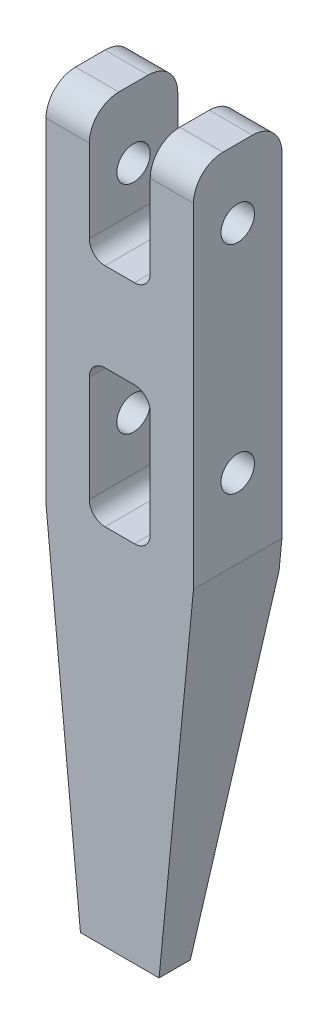
ISO-10303-21;
HEADER;
FILE_DESCRIPTION(('STEP AP214'),'2;1');
FILE_NAME('part.step','',(''),(''),'','','');
FILE_SCHEMA(('AUTOMOTIVE_DESIGN { 1 0 10303 214 1 1 1 1 }'));
ENDSEC;
DATA;
#1=APPLICATION_CONTEXT('core data for automotive mechanical design processes');
#2=APPLICATION_PROTOCOL_DEFINITION('international standard','automotive_design',2000,#1);
#3=PRODUCT_CONTEXT('',#1,'mechanical');
#4=PRODUCT('Part','Part','',(#3));
#5=PRODUCT_RELATED_PRODUCT_CATEGORY('part','',(#4));
#6=PRODUCT_DEFINITION_FORMATION('','',#4);
#7=PRODUCT_DEFINITION_CONTEXT('part definition',#1,'design');
#8=PRODUCT_DEFINITION('design','',#6,#7);
#9=PRODUCT_DEFINITION_SHAPE('','',#8);
#10=(LENGTH_UNIT() NAMED_UNIT(*) SI_UNIT(.MILLI.,.METRE.));
#11=(NAMED_UNIT(*) PLANE_ANGLE_UNIT() SI_UNIT($,.RADIAN.));
#12=(NAMED_UNIT(*) SI_UNIT($,.STERADIAN.) SOLID_ANGLE_UNIT());
#13=UNCERTAINTY_MEASURE_WITH_UNIT(LENGTH_MEASURE(1.E-05),#10,'distance_accuracy_value','');
#14=(GEOMETRIC_REPRESENTATION_CONTEXT(3) GLOBAL_UNCERTAINTY_ASSIGNED_CONTEXT((#13)) GLOBAL_UNIT_ASSIGNED_CONTEXT((#10,
#11,#12)) REPRESENTATION_CONTEXT('',''));
#15=CARTESIAN_POINT('',(0.,0.,0.));
#16=DIRECTION('',(0.,0.,1.));
#17=DIRECTION('',(1.,0.,0.));
#18=AXIS2_PLACEMENT_3D('',#15,#16,#17);
#19=CARTESIAN_POINT('',(3.75,-33.,2.25));
#20=DIRECTION('',(0.,0.,-1.));
#21=DIRECTION('',(0.,1.,0.));
#22=AXIS2_PLACEMENT_3D('',#19,#20,#21);
#23=PLANE('',#22);
#24=DIRECTION('',(-1.,0.,0.));
#25=VECTOR('',#24,1.);
#26=CARTESIAN_POINT('',(3.75,-33.,2.25));
#27=LINE('',#26,#25);
#28=CARTESIAN_POINT('',(2.,-33.,2.25));
#29=VERTEX_POINT('',#28);
#30=CARTESIAN_POINT('',(-2.,-33.,2.25));
#31=VERTEX_POINT('',#30);
#32=EDGE_CURVE('E242',#29,#31,#27,.T.);
#33=ORIENTED_EDGE('',*,*,#32,.F.);
#34=DIRECTION('',(-0.0967659740606516,-0.995307161766705,0.));
#35=VECTOR('',#34,1.);
#36=CARTESIAN_POINT('',(3.75,-15.,2.25));
#37=LINE('',#36,#35);
#38=CARTESIAN_POINT('',(3.75,-15.,2.25));
#39=VERTEX_POINT('',#38);
#40=EDGE_CURVE('E206',#39,#29,#37,.T.);
#41=ORIENTED_EDGE('',*,*,#40,.F.);
#42=DIRECTION('',(0.,-1.,0.));
#43=VECTOR('',#42,1.);
#44=CARTESIAN_POINT('',(3.75,-33.,2.25));
#45=LINE('',#44,#43);
#46=CARTESIAN_POINT('',(3.75,2.,2.25));
#47=VERTEX_POINT('',#46);
#48=EDGE_CURVE('E215',#47,#39,#45,.T.);
#49=ORIENTED_EDGE('',*,*,#48,.F.);
#50=DIRECTION('',(-1.,0.,0.));
#51=VECTOR('',#50,1.);
#52=CARTESIAN_POINT('',(3.75,2.,2.25));
#53=LINE('',#52,#51);
#54=CARTESIAN_POINT('',(1.55,2.,2.25));
#55=VERTEX_POINT('',#54);
#56=EDGE_CURVE('E264',#47,#55,#53,.T.);
#57=ORIENTED_EDGE('',*,*,#56,.T.);
#58=DIRECTION('',(0.,-1.,0.));
#59=VECTOR('',#58,1.);
#60=CARTESIAN_POINT('',(1.55,0.,2.25));
#61=LINE('',#60,#59);
#62=CARTESIAN_POINT('',(1.55,-2.2,2.25));
#63=VERTEX_POINT('',#62);
#64=EDGE_CURVE('E261',#55,#63,#61,.T.);
#65=ORIENTED_EDGE('',*,*,#64,.T.);
#66=CARTESIAN_POINT('',(0.750000000000001,-2.2,2.25));
#67=DIRECTION('',(0.,0.,-1.));
#68=DIRECTION('',(0.,1.,0.));
#69=AXIS2_PLACEMENT_3D('',#66,#67,#68);
#70=CIRCLE('',#69,0.8);
#71=CARTESIAN_POINT('',(0.750000000000001,-3.,2.25));
#72=VERTEX_POINT('',#71);
#73=EDGE_CURVE('E347',#63,#72,#70,.T.);
#74=ORIENTED_EDGE('',*,*,#73,.T.);
#75=DIRECTION('',(1.,0.,0.));
#76=VECTOR('',#75,1.);
#77=CARTESIAN_POINT('',(0.,-3.,2.25));
#78=LINE('',#77,#76);
#79=CARTESIAN_POINT('',(-0.75,-3.,2.25));
#80=VERTEX_POINT('',#79);
#81=EDGE_CURVE('E401',#80,#72,#78,.T.);
#82=ORIENTED_EDGE('',*,*,#81,.F.);
#83=CARTESIAN_POINT('',(-0.75,-2.2,2.25));
#84=DIRECTION('',(0.,0.,-1.));
#85=DIRECTION('',(0.,1.,0.));
#86=AXIS2_PLACEMENT_3D('',#83,#84,#85);
#87=CIRCLE('',#86,0.8);
#88=CARTESIAN_POINT('',(-1.55,-2.2,2.25));
#89=VERTEX_POINT('',#88);
#90=EDGE_CURVE('E343',#80,#89,#87,.T.);
#91=ORIENTED_EDGE('',*,*,#90,.T.);
#92=DIRECTION('',(0.,-1.,0.));
#93=VECTOR('',#92,1.);
#94=CARTESIAN_POINT('',(-1.55,0.,2.25));
#95=LINE('',#94,#93);
#96=CARTESIAN_POINT('',(-1.55,2.,2.25));
#97=VERTEX_POINT('',#96);
#98=EDGE_CURVE('E398',#97,#89,#95,.T.);
#99=ORIENTED_EDGE('',*,*,#98,.F.);
#100=DIRECTION('',(-1.,0.,0.));
#101=VECTOR('',#100,1.);
#102=CARTESIAN_POINT('',(3.75,2.,2.25));
#103=LINE('',#102,#101);
#104=CARTESIAN_POINT('',(-3.75,2.,2.25));
#105=VERTEX_POINT('',#104);
#106=EDGE_CURVE('E244',#97,#105,#103,.T.);
#107=ORIENTED_EDGE('',*,*,#106,.T.);
#108=DIRECTION('',(0.,-1.,0.));
#109=VECTOR('',#108,1.);
#110=CARTESIAN_POINT('',(-3.75,-33.,2.25));
#111=LINE('',#110,#109);
#112=CARTESIAN_POINT('',(-3.75,-15.,2.25));
#113=VERTEX_POINT('',#112);
#114=EDGE_CURVE('E231',#105,#113,#111,.T.);
#115=ORIENTED_EDGE('',*,*,#114,.T.);
#116=DIRECTION('',(-0.096765974060652,0.995307161766705,0.));
#117=VECTOR('',#116,1.);
#118=CARTESIAN_POINT('',(-3.75,-15.,2.25));
#119=LINE('',#118,#117);
#120=EDGE_CURVE('E370',#31,#113,#119,.T.);
#121=ORIENTED_EDGE('',*,*,#120,.F.);
#122=EDGE_LOOP('',(#33,#41,#49,#57,#65,#74,#82,#91,#99,#107,#115,#121));
#123=FACE_BOUND('',#122,.T.);
#124=DIRECTION('',(0.,-1.,0.));
#125=VECTOR('',#124,1.);
#126=CARTESIAN_POINT('',(-1.55,-7.5,2.25));
#127=LINE('',#126,#125);
#128=CARTESIAN_POINT('',(-1.55,-8.3,2.25));
#129=VERTEX_POINT('',#128);
#130=CARTESIAN_POINT('',(-1.55,-13.7,2.25));
#131=VERTEX_POINT('',#130);
#132=EDGE_CURVE('E385',#129,#131,#127,.T.);
#133=ORIENTED_EDGE('',*,*,#132,.F.);
#134=CARTESIAN_POINT('',(-0.749999999999999,-8.3,2.25));
#135=DIRECTION('',(0.,0.,-1.));
#136=DIRECTION('',(0.,1.,0.));
#137=AXIS2_PLACEMENT_3D('',#134,#135,#136);
#138=CIRCLE('',#137,0.8);
#139=CARTESIAN_POINT('',(-0.749999999999999,-7.5,2.25));
#140=VERTEX_POINT('',#139);
#141=EDGE_CURVE('E331',#129,#140,#138,.T.);
#142=ORIENTED_EDGE('',*,*,#141,.T.);
#143=DIRECTION('',(1.,0.,0.));
#144=VECTOR('',#143,1.);
#145=CARTESIAN_POINT('',(-1.55,-7.5,2.25));
#146=LINE('',#145,#144);
#147=CARTESIAN_POINT('',(0.750000000000001,-7.5,2.25));
#148=VERTEX_POINT('',#147);
#149=EDGE_CURVE('E258',#140,#148,#146,.T.);
#150=ORIENTED_EDGE('',*,*,#149,.T.);
#151=CARTESIAN_POINT('',(0.750000000000001,-8.3,2.25));
#152=DIRECTION('',(0.,0.,-1.));
#153=DIRECTION('',(0.,1.,0.));
#154=AXIS2_PLACEMENT_3D('',#151,#152,#153);
#155=CIRCLE('',#154,0.8);
#156=CARTESIAN_POINT('',(1.55,-8.3,2.25));
#157=VERTEX_POINT('',#156);
#158=EDGE_CURVE('E327',#148,#157,#155,.T.);
#159=ORIENTED_EDGE('',*,*,#158,.T.);
#160=DIRECTION('',(0.,-1.,0.));
#161=VECTOR('',#160,1.);
#162=CARTESIAN_POINT('',(1.55,-7.5,2.25));
#163=LINE('',#162,#161);
#164=CARTESIAN_POINT('',(1.55,-13.7,2.25));
#165=VERTEX_POINT('',#164);
#166=EDGE_CURVE('E391',#157,#165,#163,.T.);
#167=ORIENTED_EDGE('',*,*,#166,.T.);
#168=CARTESIAN_POINT('',(0.750000000000001,-13.7,2.25));
#169=DIRECTION('',(0.,0.,-1.));
#170=DIRECTION('',(0.,1.,0.));
#171=AXIS2_PLACEMENT_3D('',#168,#169,#170);
#172=CIRCLE('',#171,0.8);
#173=CARTESIAN_POINT('',(0.750000000000001,-14.5,2.25));
#174=VERTEX_POINT('',#173);
#175=EDGE_CURVE('E335',#165,#174,#172,.T.);
#176=ORIENTED_EDGE('',*,*,#175,.T.);
#177=DIRECTION('',(1.,0.,0.));
#178=VECTOR('',#177,1.);
#179=CARTESIAN_POINT('',(-1.55,-14.5,2.25));
#180=LINE('',#179,#178);
#181=CARTESIAN_POINT('',(-0.749999999999998,-14.5,2.25));
#182=VERTEX_POINT('',#181);
#183=EDGE_CURVE('E388',#182,#174,#180,.T.);
#184=ORIENTED_EDGE('',*,*,#183,.F.);
#185=CARTESIAN_POINT('',(-0.749999999999998,-13.7,2.25));
#186=DIRECTION('',(0.,0.,-1.));
#187=DIRECTION('',(0.,1.,0.));
#188=AXIS2_PLACEMENT_3D('',#185,#186,#187);
#189=CIRCLE('',#188,0.8);
#190=EDGE_CURVE('E339',#182,#131,#189,.T.);
#191=ORIENTED_EDGE('',*,*,#190,.T.);
#192=EDGE_LOOP('',(#133,#142,#150,#159,#167,#176,#184,#191));
#193=FACE_BOUND('',#192,.T.);
#194=ADVANCED_FACE('F35',(#123,#193),#23,.F.);
#195=CARTESIAN_POINT('',(3.75,3.5,-2.25));
#196=DIRECTION('',(0.,0.,1.));
#197=DIRECTION('',(0.,-1.,0.));
#198=AXIS2_PLACEMENT_3D('',#195,#196,#197);
#199=PLANE('',#198);
#200=DIRECTION('',(0.,1.,0.));
#201=VECTOR('',#200,1.);
#202=CARTESIAN_POINT('',(3.75,3.5,-2.25));
#203=LINE('',#202,#201);
#204=CARTESIAN_POINT('',(3.75,-15.,-2.25));
#205=VERTEX_POINT('',#204);
#206=CARTESIAN_POINT('',(3.75,2.,-2.25));
#207=VERTEX_POINT('',#206);
#208=EDGE_CURVE('E212',#205,#207,#203,.T.);
#209=ORIENTED_EDGE('',*,*,#208,.F.);
#210=DIRECTION('',(-0.0967659740606516,-0.995307161766705,0.));
#211=VECTOR('',#210,1.);
#212=CARTESIAN_POINT('',(3.75,-15.,-2.25));
#213=LINE('',#212,#211);
#214=CARTESIAN_POINT('',(3.60416666666667,-16.5,-2.25));
#215=VERTEX_POINT('',#214);
#216=EDGE_CURVE('E200',#205,#215,#213,.T.);
#217=ORIENTED_EDGE('',*,*,#216,.T.);
#218=DIRECTION('',(-1.,0.,0.));
#219=VECTOR('',#218,1.);
#220=CARTESIAN_POINT('',(3.75,-16.5,-2.25));
#221=LINE('',#220,#219);
#222=CARTESIAN_POINT('',(-3.60416666666667,-16.5,-2.25));
#223=VERTEX_POINT('',#222);
#224=EDGE_CURVE('E57',#215,#223,#221,.T.);
#225=ORIENTED_EDGE('',*,*,#224,.T.);
#226=DIRECTION('',(-0.096765974060652,0.995307161766705,0.));
#227=VECTOR('',#226,1.);
#228=CARTESIAN_POINT('',(-3.75,-15.,-2.25));
#229=LINE('',#228,#227);
#230=CARTESIAN_POINT('',(-3.75,-15.,-2.25));
#231=VERTEX_POINT('',#230);
#232=EDGE_CURVE('E361',#223,#231,#229,.T.);
#233=ORIENTED_EDGE('',*,*,#232,.T.);
#234=DIRECTION('',(0.,1.,0.));
#235=VECTOR('',#234,1.);
#236=CARTESIAN_POINT('',(-3.75,3.5,-2.25));
#237=LINE('',#236,#235);
#238=CARTESIAN_POINT('',(-3.75,2.,-2.25));
#239=VERTEX_POINT('',#238);
#240=EDGE_CURVE('E234',#231,#239,#237,.T.);
#241=ORIENTED_EDGE('',*,*,#240,.T.);
#242=DIRECTION('',(-1.,0.,0.));
#243=VECTOR('',#242,1.);
#244=CARTESIAN_POINT('',(3.75,2.,-2.25));
#245=LINE('',#244,#243);
#246=CARTESIAN_POINT('',(-1.55,2.,-2.25));
#247=VERTEX_POINT('',#246);
#248=EDGE_CURVE('E280',#239,#247,#245,.F.);
#249=ORIENTED_EDGE('',*,*,#248,.T.);
#250=DIRECTION('',(0.,-1.,0.));
#251=VECTOR('',#250,1.);
#252=CARTESIAN_POINT('',(-1.55,0.,-2.25));
#253=LINE('',#252,#251);
#254=CARTESIAN_POINT('',(-1.55,-2.2,-2.25));
#255=VERTEX_POINT('',#254);
#256=EDGE_CURVE('E407',#247,#255,#253,.T.);
#257=ORIENTED_EDGE('',*,*,#256,.T.);
#258=CARTESIAN_POINT('',(-0.75,-2.2,-2.25));
#259=DIRECTION('',(0.,0.,1.));
#260=DIRECTION('',(0.,-1.,0.));
#261=AXIS2_PLACEMENT_3D('',#258,#259,#260);
#262=CIRCLE('',#261,0.8);
#263=CARTESIAN_POINT('',(-0.75,-3.,-2.25));
#264=VERTEX_POINT('',#263);
#265=EDGE_CURVE('E345',#255,#264,#262,.T.);
#266=ORIENTED_EDGE('',*,*,#265,.T.);
#267=DIRECTION('',(1.,0.,0.));
#268=VECTOR('',#267,1.);
#269=CARTESIAN_POINT('',(0.,-3.,-2.25));
#270=LINE('',#269,#268);
#271=CARTESIAN_POINT('',(0.750000000000001,-3.,-2.25));
#272=VERTEX_POINT('',#271);
#273=EDGE_CURVE('E249',#264,#272,#270,.T.);
#274=ORIENTED_EDGE('',*,*,#273,.T.);
#275=CARTESIAN_POINT('',(0.750000000000001,-2.2,-2.25));
#276=DIRECTION('',(0.,0.,1.));
#277=DIRECTION('',(0.,-1.,0.));
#278=AXIS2_PLACEMENT_3D('',#275,#276,#277);
#279=CIRCLE('',#278,0.8);
#280=CARTESIAN_POINT('',(1.55,-2.2,-2.25));
#281=VERTEX_POINT('',#280);
#282=EDGE_CURVE('E349',#272,#281,#279,.T.);
#283=ORIENTED_EDGE('',*,*,#282,.T.);
#284=DIRECTION('',(0.,-1.,0.));
#285=VECTOR('',#284,1.);
#286=CARTESIAN_POINT('',(1.55,0.,-2.25));
#287=LINE('',#286,#285);
#288=CARTESIAN_POINT('',(1.55,2.,-2.25));
#289=VERTEX_POINT('',#288);
#290=EDGE_CURVE('E404',#289,#281,#287,.T.);
#291=ORIENTED_EDGE('',*,*,#290,.F.);
#292=DIRECTION('',(-1.,0.,0.));
#293=VECTOR('',#292,1.);
#294=CARTESIAN_POINT('',(3.75,2.,-2.25));
#295=LINE('',#294,#293);
#296=EDGE_CURVE('E221',#289,#207,#295,.F.);
#297=ORIENTED_EDGE('',*,*,#296,.T.);
#298=EDGE_LOOP('',(#209,#217,#225,#233,#241,#249,#257,#266,#274,#283,#291,#297));
#299=FACE_BOUND('',#298,.T.);
#300=DIRECTION('',(1.,0.,0.));
#301=VECTOR('',#300,1.);
#302=CARTESIAN_POINT('',(-1.55,-7.5,-2.25));
#303=LINE('',#302,#301);
#304=CARTESIAN_POINT('',(-0.749999999999999,-7.5,-2.25));
#305=VERTEX_POINT('',#304);
#306=CARTESIAN_POINT('',(0.750000000000001,-7.5,-2.25));
#307=VERTEX_POINT('',#306);
#308=EDGE_CURVE('E382',#305,#307,#303,.T.);
#309=ORIENTED_EDGE('',*,*,#308,.F.);
#310=CARTESIAN_POINT('',(-0.749999999999999,-8.3,-2.25));
#311=DIRECTION('',(0.,0.,1.));
#312=DIRECTION('',(0.,-1.,0.));
#313=AXIS2_PLACEMENT_3D('',#310,#311,#312);
#314=CIRCLE('',#313,0.8);
#315=CARTESIAN_POINT('',(-1.55,-8.3,-2.25));
#316=VERTEX_POINT('',#315);
#317=EDGE_CURVE('E333',#305,#316,#314,.T.);
#318=ORIENTED_EDGE('',*,*,#317,.T.);
#319=DIRECTION('',(0.,-1.,0.));
#320=VECTOR('',#319,1.);
#321=CARTESIAN_POINT('',(-1.55,-7.5,-2.25));
#322=LINE('',#321,#320);
#323=CARTESIAN_POINT('',(-1.55,-13.7,-2.25));
#324=VERTEX_POINT('',#323);
#325=EDGE_CURVE('E368',#316,#324,#322,.T.);
#326=ORIENTED_EDGE('',*,*,#325,.T.);
#327=CARTESIAN_POINT('',(-0.749999999999998,-13.7,-2.25));
#328=DIRECTION('',(0.,0.,1.));
#329=DIRECTION('',(0.,-1.,0.));
#330=AXIS2_PLACEMENT_3D('',#327,#328,#329);
#331=CIRCLE('',#330,0.8);
#332=CARTESIAN_POINT('',(-0.749999999999998,-14.5,-2.25));
#333=VERTEX_POINT('',#332);
#334=EDGE_CURVE('E341',#324,#333,#331,.T.);
#335=ORIENTED_EDGE('',*,*,#334,.T.);
#336=DIRECTION('',(1.,0.,0.));
#337=VECTOR('',#336,1.);
#338=CARTESIAN_POINT('',(-1.55,-14.5,-2.25));
#339=LINE('',#338,#337);
#340=CARTESIAN_POINT('',(0.750000000000001,-14.5,-2.25));
#341=VERTEX_POINT('',#340);
#342=EDGE_CURVE('E376',#333,#341,#339,.T.);
#343=ORIENTED_EDGE('',*,*,#342,.T.);
#344=CARTESIAN_POINT('',(0.750000000000001,-13.7,-2.25));
#345=DIRECTION('',(0.,0.,1.));
#346=DIRECTION('',(0.,-1.,0.));
#347=AXIS2_PLACEMENT_3D('',#344,#345,#346);
#348=CIRCLE('',#347,0.8);
#349=CARTESIAN_POINT('',(1.55,-13.7,-2.25));
#350=VERTEX_POINT('',#349);
#351=EDGE_CURVE('E337',#341,#350,#348,.T.);
#352=ORIENTED_EDGE('',*,*,#351,.T.);
#353=DIRECTION('',(0.,-1.,0.));
#354=VECTOR('',#353,1.);
#355=CARTESIAN_POINT('',(1.55,-7.5,-2.25));
#356=LINE('',#355,#354);
#357=CARTESIAN_POINT('',(1.55,-8.3,-2.25));
#358=VERTEX_POINT('',#357);
#359=EDGE_CURVE('E379',#358,#350,#356,.T.);
#360=ORIENTED_EDGE('',*,*,#359,.F.);
#361=CARTESIAN_POINT('',(0.750000000000001,-8.3,-2.25));
#362=DIRECTION('',(0.,0.,1.));
#363=DIRECTION('',(0.,-1.,0.));
#364=AXIS2_PLACEMENT_3D('',#361,#362,#363);
#365=CIRCLE('',#364,0.8);
#366=EDGE_CURVE('E329',#358,#307,#365,.T.);
#367=ORIENTED_EDGE('',*,*,#366,.T.);
#368=EDGE_LOOP('',(#309,#318,#326,#335,#343,#352,#360,#367));
#369=FACE_BOUND('',#368,.T.);
#370=ADVANCED_FACE('F217',(#299,#369),#199,.F.);
#371=CARTESIAN_POINT('',(3.75,-11.,0.));
#372=DIRECTION('',(-1.,0.,0.));
#373=DIRECTION('',(0.,0.,1.));
#374=AXIS2_PLACEMENT_3D('',#371,#372,#373);
#375=CYLINDRICAL_SURFACE('',#374,0.85);
#376=CARTESIAN_POINT('',(3.75,-11.,0.));
#377=DIRECTION('',(1.,0.,0.));
#378=DIRECTION('',(0.,0.,-1.));
#379=AXIS2_PLACEMENT_3D('',#376,#377,#378);
#380=CIRCLE('',#379,0.85);
#381=CARTESIAN_POINT('',(3.75,-11.,-0.85));
#382=VERTEX_POINT('',#381);
#383=EDGE_CURVE('E417',#382,#382,#380,.T.);
#384=ORIENTED_EDGE('',*,*,#383,.T.);
#385=EDGE_LOOP('',(#384));
#386=FACE_BOUND('',#385,.T.);
#387=CARTESIAN_POINT('',(1.55,-11.,0.));
#388=DIRECTION('',(-1.,0.,0.));
#389=DIRECTION('',(0.,-1.,0.));
#390=AXIS2_PLACEMENT_3D('',#387,#388,#389);
#391=CIRCLE('',#390,0.85);
#392=CARTESIAN_POINT('',(1.55,-11.85,0.));
#393=VERTEX_POINT('',#392);
#394=EDGE_CURVE('E257',#393,#393,#391,.T.);
#395=ORIENTED_EDGE('',*,*,#394,.T.);
#396=EDGE_LOOP('',(#395));
#397=FACE_BOUND('',#396,.T.);
#398=ADVANCED_FACE('F444',(#386,#397),#375,.F.);
#399=CARTESIAN_POINT('',(3.75,3.5,2.25));
#400=DIRECTION('',(0.,-1.,0.));
#401=DIRECTION('',(0.,0.,-1.));
#402=AXIS2_PLACEMENT_3D('',#399,#400,#401);
#403=PLANE('',#402);
#404=DIRECTION('',(0.,0.,-1.));
#405=VECTOR('',#404,1.);
#406=CARTESIAN_POINT('',(1.55,3.5,2.25));
#407=LINE('',#406,#405);
#408=CARTESIAN_POINT('',(1.55,3.5,0.749999999999997));
#409=VERTEX_POINT('',#408);
#410=CARTESIAN_POINT('',(1.55,3.5,-0.749999999999996));
#411=VERTEX_POINT('',#410);
#412=EDGE_CURVE('E253',#409,#411,#407,.T.);
#413=ORIENTED_EDGE('',*,*,#412,.F.);
#414=DIRECTION('',(-1.,0.,0.));
#415=VECTOR('',#414,1.);
#416=CARTESIAN_POINT('',(3.75,3.5,0.749999999999997));
#417=LINE('',#416,#415);
#418=CARTESIAN_POINT('',(3.75,3.5,0.749999999999997));
#419=VERTEX_POINT('',#418);
#420=EDGE_CURVE('E274',#409,#419,#417,.F.);
#421=ORIENTED_EDGE('',*,*,#420,.T.);
#422=DIRECTION('',(0.,0.,1.));
#423=VECTOR('',#422,1.);
#424=CARTESIAN_POINT('',(3.75,3.5,2.25));
#425=LINE('',#424,#423);
#426=CARTESIAN_POINT('',(3.75,3.5,-0.749999999999996));
#427=VERTEX_POINT('',#426);
#428=EDGE_CURVE('E223',#427,#419,#425,.T.);
#429=ORIENTED_EDGE('',*,*,#428,.F.);
#430=DIRECTION('',(-1.,0.,0.));
#431=VECTOR('',#430,1.);
#432=CARTESIAN_POINT('',(3.75,3.5,-0.749999999999996));
#433=LINE('',#432,#431);
#434=EDGE_CURVE('E271',#427,#411,#433,.T.);
#435=ORIENTED_EDGE('',*,*,#434,.T.);
#436=EDGE_LOOP('',(#413,#421,#429,#435));
#437=FACE_BOUND('',#436,.T.);
#438=ADVANCED_FACE('F447',(#437),#403,.F.);
#439=CARTESIAN_POINT('',(3.75,0.,0.));
#440=DIRECTION('',(-1.,0.,0.));
#441=DIRECTION('',(0.,0.,1.));
#442=AXIS2_PLACEMENT_3D('',#439,#440,#441);
#443=CYLINDRICAL_SURFACE('',#442,0.85);
#444=CARTESIAN_POINT('',(3.75,0.,0.));
#445=DIRECTION('',(1.,0.,0.));
#446=DIRECTION('',(0.,0.,-1.));
#447=AXIS2_PLACEMENT_3D('',#444,#445,#446);
#448=CIRCLE('',#447,0.85);
#449=CARTESIAN_POINT('',(3.75,0.,-0.85));
#450=VERTEX_POINT('',#449);
#451=EDGE_CURVE('E235',#450,#450,#448,.T.);
#452=ORIENTED_EDGE('',*,*,#451,.T.);
#453=EDGE_LOOP('',(#452));
#454=FACE_BOUND('',#453,.T.);
#455=CARTESIAN_POINT('',(1.55,0.,0.));
#456=DIRECTION('',(-1.,0.,0.));
#457=DIRECTION('',(0.,-1.,0.));
#458=AXIS2_PLACEMENT_3D('',#455,#456,#457);
#459=CIRCLE('',#458,0.85);
#460=CARTESIAN_POINT('',(1.55,-0.85,0.));
#461=VERTEX_POINT('',#460);
#462=EDGE_CURVE('E250',#461,#461,#459,.T.);
#463=ORIENTED_EDGE('',*,*,#462,.T.);
#464=EDGE_LOOP('',(#463));
#465=FACE_BOUND('',#464,.T.);
#466=ADVANCED_FACE('F436',(#454,#465),#443,.F.);
#467=CARTESIAN_POINT('',(3.75,0.,0.));
#468=DIRECTION('',(-1.,0.,0.));
#469=DIRECTION('',(0.,0.,1.));
#470=AXIS2_PLACEMENT_3D('',#467,#468,#469);
#471=PLANE('',#470);
#472=ORIENTED_EDGE('',*,*,#451,.F.);
#473=EDGE_LOOP('',(#472));
#474=FACE_BOUND('',#473,.T.);
#475=ORIENTED_EDGE('',*,*,#48,.T.);
#476=DIRECTION('',(0.,0.,1.));
#477=VECTOR('',#476,1.);
#478=CARTESIAN_POINT('',(3.75,-15.,-2.25));
#479=LINE('',#478,#477);
#480=EDGE_CURVE('E203',#205,#39,#479,.T.);
#481=ORIENTED_EDGE('',*,*,#480,.F.);
#482=ORIENTED_EDGE('',*,*,#208,.T.);
#483=CARTESIAN_POINT('',(3.75,2.,-0.749999999999996));
#484=DIRECTION('',(-1.,0.,0.));
#485=DIRECTION('',(0.,0.,1.));
#486=AXIS2_PLACEMENT_3D('',#483,#484,#485);
#487=CIRCLE('',#486,1.5);
#488=EDGE_CURVE('E276',#207,#427,#487,.F.);
#489=ORIENTED_EDGE('',*,*,#488,.T.);
#490=ORIENTED_EDGE('',*,*,#428,.T.);
#491=CARTESIAN_POINT('',(3.75,2.,0.749999999999997));
#492=DIRECTION('',(-1.,0.,0.));
#493=DIRECTION('',(0.,0.,1.));
#494=AXIS2_PLACEMENT_3D('',#491,#492,#493);
#495=CIRCLE('',#494,1.5);
#496=EDGE_CURVE('E278',#419,#47,#495,.F.);
#497=ORIENTED_EDGE('',*,*,#496,.T.);
#498=EDGE_LOOP('',(#475,#481,#482,#489,#490,#497));
#499=FACE_BOUND('',#498,.T.);
#500=ORIENTED_EDGE('',*,*,#383,.F.);
#501=EDGE_LOOP('',(#500));
#502=FACE_BOUND('',#501,.T.);
#503=ADVANCED_FACE('F210',(#474,#499,#502),#471,.F.);
#504=CARTESIAN_POINT('',(-3.75,0.,0.));
#505=DIRECTION('',(-1.,0.,0.));
#506=DIRECTION('',(0.,0.,1.));
#507=AXIS2_PLACEMENT_3D('',#504,#505,#506);
#508=PLANE('',#507);
#509=DIRECTION('',(0.,0.,1.));
#510=VECTOR('',#509,1.);
#511=CARTESIAN_POINT('',(-3.75,-15.,-2.25));
#512=LINE('',#511,#510);
#513=EDGE_CURVE('E365',#231,#113,#512,.T.);
#514=ORIENTED_EDGE('',*,*,#513,.T.);
#515=ORIENTED_EDGE('',*,*,#114,.F.);
#516=CARTESIAN_POINT('',(-3.75,2.,0.749999999999997));
#517=DIRECTION('',(-1.,0.,0.));
#518=DIRECTION('',(0.,0.,1.));
#519=AXIS2_PLACEMENT_3D('',#516,#517,#518);
#520=CIRCLE('',#519,1.5);
#521=CARTESIAN_POINT('',(-3.75,3.5,0.749999999999997));
#522=VERTEX_POINT('',#521);
#523=EDGE_CURVE('E288',#105,#522,#520,.T.);
#524=ORIENTED_EDGE('',*,*,#523,.T.);
#525=DIRECTION('',(0.,0.,1.));
#526=VECTOR('',#525,1.);
#527=CARTESIAN_POINT('',(-3.75,3.5,2.25));
#528=LINE('',#527,#526);
#529=CARTESIAN_POINT('',(-3.75,3.5,-0.749999999999996));
#530=VERTEX_POINT('',#529);
#531=EDGE_CURVE('E227',#530,#522,#528,.T.);
#532=ORIENTED_EDGE('',*,*,#531,.F.);
#533=CARTESIAN_POINT('',(-3.75,2.,-0.749999999999996));
#534=DIRECTION('',(-1.,0.,0.));
#535=DIRECTION('',(0.,0.,1.));
#536=AXIS2_PLACEMENT_3D('',#533,#534,#535);
#537=CIRCLE('',#536,1.5);
#538=EDGE_CURVE('E290',#530,#239,#537,.T.);
#539=ORIENTED_EDGE('',*,*,#538,.T.);
#540=ORIENTED_EDGE('',*,*,#240,.F.);
#541=EDGE_LOOP('',(#514,#515,#524,#532,#539,#540));
#542=FACE_BOUND('',#541,.T.);
#543=CARTESIAN_POINT('',(-3.75,0.,0.));
#544=DIRECTION('',(1.,0.,0.));
#545=DIRECTION('',(0.,0.,-1.));
#546=AXIS2_PLACEMENT_3D('',#543,#544,#545);
#547=CIRCLE('',#546,0.85);
#548=CARTESIAN_POINT('',(-3.75,0.,-0.85));
#549=VERTEX_POINT('',#548);
#550=EDGE_CURVE('E420',#549,#549,#547,.T.);
#551=ORIENTED_EDGE('',*,*,#550,.T.);
#552=EDGE_LOOP('',(#551));
#553=FACE_BOUND('',#552,.T.);
#554=CARTESIAN_POINT('',(-3.75,-11.,0.));
#555=DIRECTION('',(1.,0.,0.));
#556=DIRECTION('',(0.,0.,-1.));
#557=AXIS2_PLACEMENT_3D('',#554,#555,#556);
#558=CIRCLE('',#557,0.85);
#559=CARTESIAN_POINT('',(-3.75,-11.,-0.85));
#560=VERTEX_POINT('',#559);
#561=EDGE_CURVE('E416',#560,#560,#558,.T.);
#562=ORIENTED_EDGE('',*,*,#561,.T.);
#563=EDGE_LOOP('',(#562));
#564=FACE_BOUND('',#563,.T.);
#565=ADVANCED_FACE('F427',(#542,#553,#564),#508,.T.);
#566=CARTESIAN_POINT('',(3.75,-33.,0.659395181689601));
#567=DIRECTION('',(0.,1.,0.));
#568=DIRECTION('',(0.,0.,1.));
#569=AXIS2_PLACEMENT_3D('',#566,#567,#568);
#570=PLANE('',#569);
#571=DIRECTION('',(-1.,0.,0.));
#572=VECTOR('',#571,1.);
#573=CARTESIAN_POINT('',(3.75,-33.,0.659395181689601));
#574=LINE('',#573,#572);
#575=CARTESIAN_POINT('',(2.,-33.,0.659395181689601));
#576=VERTEX_POINT('',#575);
#577=CARTESIAN_POINT('',(-2.,-33.,0.659395181689601));
#578=VERTEX_POINT('',#577);
#579=EDGE_CURVE('E240',#576,#578,#574,.T.);
#580=ORIENTED_EDGE('',*,*,#579,.F.);
#581=DIRECTION('',(0.,0.,1.));
#582=VECTOR('',#581,1.);
#583=CARTESIAN_POINT('',(2.,-33.,-2.25));
#584=LINE('',#583,#582);
#585=EDGE_CURVE('E50',#576,#29,#584,.T.);
#586=ORIENTED_EDGE('',*,*,#585,.T.);
#587=ORIENTED_EDGE('',*,*,#32,.T.);
#588=DIRECTION('',(0.,0.,1.));
#589=VECTOR('',#588,1.);
#590=CARTESIAN_POINT('',(-2.,-33.,-2.25));
#591=LINE('',#590,#589);
#592=EDGE_CURVE('E359',#578,#31,#591,.T.);
#593=ORIENTED_EDGE('',*,*,#592,.F.);
#594=EDGE_LOOP('',(#580,#586,#587,#593));
#595=FACE_BOUND('',#594,.T.);
#596=ADVANCED_FACE('F363',(#595),#570,.F.);
#597=CARTESIAN_POINT('',(3.75,-16.5,-2.25));
#598=DIRECTION('',(0.,0.173648177666926,0.984807753012209));
#599=DIRECTION('',(0.,-0.984807753012209,0.173648177666926));
#600=AXIS2_PLACEMENT_3D('',#597,#598,#599);
#601=PLANE('',#600);
#602=ORIENTED_EDGE('',*,*,#224,.F.);
#603=DIRECTION('',(-0.0953093376668006,-0.98032461600138,0.172857679653705));
#604=VECTOR('',#603,1.);
#605=CARTESIAN_POINT('',(3.60549139768595,-16.4863741952303,-2.25240259701477));
#606=LINE('',#605,#604);
#607=EDGE_CURVE('E11',#215,#576,#606,.T.);
#608=ORIENTED_EDGE('',*,*,#607,.T.);
#609=ORIENTED_EDGE('',*,*,#579,.T.);
#610=DIRECTION('',(-0.095309337666801,0.98032461600138,-0.172857679653705));
#611=VECTOR('',#610,1.);
#612=CARTESIAN_POINT('',(-3.53736237383731,-17.1871298691019,-2.12884046482666));
#613=LINE('',#612,#611);
#614=EDGE_CURVE('E43',#578,#223,#613,.T.);
#615=ORIENTED_EDGE('',*,*,#614,.T.);
#616=EDGE_LOOP('',(#602,#608,#609,#615));
#617=FACE_BOUND('',#616,.T.);
#618=ADVANCED_FACE('F353',(#617),#601,.F.);
#619=DIRECTION('',(0.,0.,-1.));
#620=VECTOR('',#619,1.);
#621=CARTESIAN_POINT('',(-1.55,3.5,2.25));
#622=LINE('',#621,#620);
#623=CARTESIAN_POINT('',(-1.55,3.5,0.749999999999997));
#624=VERTEX_POINT('',#623);
#625=CARTESIAN_POINT('',(-1.55,3.5,-0.749999999999996));
#626=VERTEX_POINT('',#625);
#627=EDGE_CURVE('E248',#624,#626,#622,.T.);
#628=ORIENTED_EDGE('',*,*,#627,.T.);
#629=DIRECTION('',(-1.,0.,0.));
#630=VECTOR('',#629,1.);
#631=CARTESIAN_POINT('',(3.75,3.5,-0.749999999999996));
#632=LINE('',#631,#630);
#633=EDGE_CURVE('E285',#626,#530,#632,.T.);
#634=ORIENTED_EDGE('',*,*,#633,.T.);
#635=ORIENTED_EDGE('',*,*,#531,.T.);
#636=DIRECTION('',(-1.,0.,0.));
#637=VECTOR('',#636,1.);
#638=CARTESIAN_POINT('',(3.75,3.5,0.749999999999997));
#639=LINE('',#638,#637);
#640=EDGE_CURVE('E283',#522,#624,#639,.F.);
#641=ORIENTED_EDGE('',*,*,#640,.T.);
#642=EDGE_LOOP('',(#628,#634,#635,#641));
#643=FACE_BOUND('',#642,.T.);
#644=ADVANCED_FACE('F433',(#643),#403,.F.);
#645=CARTESIAN_POINT('',(-1.55,0.,0.));
#646=DIRECTION('',(-1.,0.,0.));
#647=DIRECTION('',(0.,-1.,0.));
#648=AXIS2_PLACEMENT_3D('',#645,#646,#647);
#649=CIRCLE('',#648,0.85);
#650=CARTESIAN_POINT('',(-1.55,-0.85,0.));
#651=VERTEX_POINT('',#650);
#652=EDGE_CURVE('E245',#651,#651,#649,.T.);
#653=ORIENTED_EDGE('',*,*,#652,.F.);
#654=EDGE_LOOP('',(#653));
#655=FACE_BOUND('',#654,.T.);
#656=ORIENTED_EDGE('',*,*,#550,.F.);
#657=EDGE_LOOP('',(#656));
#658=FACE_BOUND('',#657,.T.);
#659=ADVANCED_FACE('F430',(#655,#658),#443,.F.);
#660=CARTESIAN_POINT('',(-1.55,-11.,0.));
#661=DIRECTION('',(-1.,0.,0.));
#662=DIRECTION('',(0.,-1.,0.));
#663=AXIS2_PLACEMENT_3D('',#660,#661,#662);
#664=CIRCLE('',#663,0.85);
#665=CARTESIAN_POINT('',(-1.55,-11.85,0.));
#666=VERTEX_POINT('',#665);
#667=EDGE_CURVE('E254',#666,#666,#664,.T.);
#668=ORIENTED_EDGE('',*,*,#667,.F.);
#669=EDGE_LOOP('',(#668));
#670=FACE_BOUND('',#669,.T.);
#671=ORIENTED_EDGE('',*,*,#561,.F.);
#672=EDGE_LOOP('',(#671));
#673=FACE_BOUND('',#672,.T.);
#674=ADVANCED_FACE('F432',(#670,#673),#375,.F.);
#675=CARTESIAN_POINT('',(1.55,0.,-2.25));
#676=DIRECTION('',(-1.,0.,0.));
#677=DIRECTION('',(0.,-1.,0.));
#678=AXIS2_PLACEMENT_3D('',#675,#676,#677);
#679=PLANE('',#678);
#680=ORIENTED_EDGE('',*,*,#462,.F.);
#681=EDGE_LOOP('',(#680));
#682=FACE_BOUND('',#681,.T.);
#683=ORIENTED_EDGE('',*,*,#290,.T.);
#684=DIRECTION('',(0.,0.,1.));
#685=VECTOR('',#684,1.);
#686=CARTESIAN_POINT('',(1.55,-2.2,-2.25));
#687=LINE('',#686,#685);
#688=EDGE_CURVE('E324',#281,#63,#687,.T.);
#689=ORIENTED_EDGE('',*,*,#688,.T.);
#690=ORIENTED_EDGE('',*,*,#64,.F.);
#691=CARTESIAN_POINT('',(1.55,2.,0.749999999999997));
#692=DIRECTION('',(-1.,0.,0.));
#693=DIRECTION('',(0.,-1.,0.));
#694=AXIS2_PLACEMENT_3D('',#691,#692,#693);
#695=CIRCLE('',#694,1.5);
#696=EDGE_CURVE('E269',#55,#409,#695,.T.);
#697=ORIENTED_EDGE('',*,*,#696,.T.);
#698=ORIENTED_EDGE('',*,*,#412,.T.);
#699=CARTESIAN_POINT('',(1.55,2.,-0.749999999999996));
#700=DIRECTION('',(-1.,0.,0.));
#701=DIRECTION('',(0.,-1.,0.));
#702=AXIS2_PLACEMENT_3D('',#699,#700,#701);
#703=CIRCLE('',#702,1.5);
#704=EDGE_CURVE('E267',#411,#289,#703,.T.);
#705=ORIENTED_EDGE('',*,*,#704,.T.);
#706=EDGE_LOOP('',(#683,#689,#690,#697,#698,#705));
#707=FACE_BOUND('',#706,.T.);
#708=ADVANCED_FACE('F441',(#682,#707),#679,.T.);
#709=CARTESIAN_POINT('',(-1.55,0.,-2.25));
#710=DIRECTION('',(-1.,0.,0.));
#711=DIRECTION('',(0.,-1.,0.));
#712=AXIS2_PLACEMENT_3D('',#709,#710,#711);
#713=PLANE('',#712);
#714=ORIENTED_EDGE('',*,*,#652,.T.);
#715=EDGE_LOOP('',(#714));
#716=FACE_BOUND('',#715,.T.);
#717=ORIENTED_EDGE('',*,*,#98,.T.);
#718=DIRECTION('',(0.,0.,1.));
#719=VECTOR('',#718,1.);
#720=CARTESIAN_POINT('',(-1.55,-2.2,-2.25));
#721=LINE('',#720,#719);
#722=EDGE_CURVE('E322',#89,#255,#721,.F.);
#723=ORIENTED_EDGE('',*,*,#722,.T.);
#724=ORIENTED_EDGE('',*,*,#256,.F.);
#725=CARTESIAN_POINT('',(-1.55,2.,-0.749999999999996));
#726=DIRECTION('',(-1.,0.,0.));
#727=DIRECTION('',(0.,-1.,0.));
#728=AXIS2_PLACEMENT_3D('',#725,#726,#727);
#729=CIRCLE('',#728,1.5);
#730=EDGE_CURVE('E295',#247,#626,#729,.F.);
#731=ORIENTED_EDGE('',*,*,#730,.T.);
#732=ORIENTED_EDGE('',*,*,#627,.F.);
#733=CARTESIAN_POINT('',(-1.55,2.,0.749999999999997));
#734=DIRECTION('',(-1.,0.,0.));
#735=DIRECTION('',(0.,-1.,0.));
#736=AXIS2_PLACEMENT_3D('',#733,#734,#735);
#737=CIRCLE('',#736,1.5);
#738=EDGE_CURVE('E293',#624,#97,#737,.F.);
#739=ORIENTED_EDGE('',*,*,#738,.T.);
#740=EDGE_LOOP('',(#717,#723,#724,#731,#732,#739));
#741=FACE_BOUND('',#740,.T.);
#742=ADVANCED_FACE('F538',(#716,#741),#713,.F.);
#743=CARTESIAN_POINT('',(0.,-3.,-2.25));
#744=DIRECTION('',(0.,-1.,0.));
#745=DIRECTION('',(1.,0.,0.));
#746=AXIS2_PLACEMENT_3D('',#743,#744,#745);
#747=PLANE('',#746);
#748=ORIENTED_EDGE('',*,*,#273,.F.);
#749=DIRECTION('',(0.,0.,1.));
#750=VECTOR('',#749,1.);
#751=CARTESIAN_POINT('',(-0.75,-3.,2.25));
#752=LINE('',#751,#750);
#753=EDGE_CURVE('E319',#264,#80,#752,.T.);
#754=ORIENTED_EDGE('',*,*,#753,.T.);
#755=ORIENTED_EDGE('',*,*,#81,.T.);
#756=DIRECTION('',(0.,0.,1.));
#757=VECTOR('',#756,1.);
#758=CARTESIAN_POINT('',(0.750000000000001,-3.,-2.25));
#759=LINE('',#758,#757);
#760=EDGE_CURVE('E317',#72,#272,#759,.F.);
#761=ORIENTED_EDGE('',*,*,#760,.T.);
#762=EDGE_LOOP('',(#748,#754,#755,#761));
#763=FACE_BOUND('',#762,.T.);
#764=ADVANCED_FACE('F510',(#763),#747,.F.);
#765=CARTESIAN_POINT('',(-1.55,-7.5,-2.25));
#766=DIRECTION('',(0.,-1.,0.));
#767=DIRECTION('',(0.,0.,-1.));
#768=AXIS2_PLACEMENT_3D('',#765,#766,#767);
#769=PLANE('',#768);
#770=ORIENTED_EDGE('',*,*,#308,.T.);
#771=DIRECTION('',(0.,0.,1.));
#772=VECTOR('',#771,1.);
#773=CARTESIAN_POINT('',(0.750000000000001,-7.5,2.25));
#774=LINE('',#773,#772);
#775=EDGE_CURVE('E299',#307,#148,#774,.T.);
#776=ORIENTED_EDGE('',*,*,#775,.T.);
#777=ORIENTED_EDGE('',*,*,#149,.F.);
#778=DIRECTION('',(0.,0.,1.));
#779=VECTOR('',#778,1.);
#780=CARTESIAN_POINT('',(-0.749999999999999,-7.5,-2.25));
#781=LINE('',#780,#779);
#782=EDGE_CURVE('E297',#140,#305,#781,.F.);
#783=ORIENTED_EDGE('',*,*,#782,.T.);
#784=EDGE_LOOP('',(#770,#776,#777,#783));
#785=FACE_BOUND('',#784,.T.);
#786=ADVANCED_FACE('F546',(#785),#769,.T.);
#787=CARTESIAN_POINT('',(1.55,-7.5,-2.25));
#788=DIRECTION('',(-1.,0.,0.));
#789=DIRECTION('',(0.,-1.,0.));
#790=AXIS2_PLACEMENT_3D('',#787,#788,#789);
#791=PLANE('',#790);
#792=ORIENTED_EDGE('',*,*,#394,.F.);
#793=EDGE_LOOP('',(#792));
#794=FACE_BOUND('',#793,.T.);
#795=ORIENTED_EDGE('',*,*,#166,.F.);
#796=DIRECTION('',(0.,0.,1.));
#797=VECTOR('',#796,1.);
#798=CARTESIAN_POINT('',(1.55,-8.3,-2.25));
#799=LINE('',#798,#797);
#800=EDGE_CURVE('E305',#157,#358,#799,.F.);
#801=ORIENTED_EDGE('',*,*,#800,.T.);
#802=ORIENTED_EDGE('',*,*,#359,.T.);
#803=DIRECTION('',(0.,0.,1.));
#804=VECTOR('',#803,1.);
#805=CARTESIAN_POINT('',(1.55,-13.7,-2.25));
#806=LINE('',#805,#804);
#807=EDGE_CURVE('E302',#350,#165,#806,.T.);
#808=ORIENTED_EDGE('',*,*,#807,.T.);
#809=EDGE_LOOP('',(#795,#801,#802,#808));
#810=FACE_BOUND('',#809,.T.);
#811=ADVANCED_FACE('F557',(#794,#810),#791,.T.);
#812=CARTESIAN_POINT('',(-1.55,-14.5,-2.25));
#813=DIRECTION('',(0.,-1.,0.));
#814=DIRECTION('',(0.,0.,-1.));
#815=AXIS2_PLACEMENT_3D('',#812,#813,#814);
#816=PLANE('',#815);
#817=ORIENTED_EDGE('',*,*,#183,.T.);
#818=DIRECTION('',(0.,0.,1.));
#819=VECTOR('',#818,1.);
#820=CARTESIAN_POINT('',(0.750000000000001,-14.5,-2.25));
#821=LINE('',#820,#819);
#822=EDGE_CURVE('E315',#174,#341,#821,.F.);
#823=ORIENTED_EDGE('',*,*,#822,.T.);
#824=ORIENTED_EDGE('',*,*,#342,.F.);
#825=DIRECTION('',(0.,0.,1.));
#826=VECTOR('',#825,1.);
#827=CARTESIAN_POINT('',(-0.749999999999998,-14.5,2.25));
#828=LINE('',#827,#826);
#829=EDGE_CURVE('E312',#333,#182,#828,.T.);
#830=ORIENTED_EDGE('',*,*,#829,.T.);
#831=EDGE_LOOP('',(#817,#823,#824,#830));
#832=FACE_BOUND('',#831,.T.);
#833=ADVANCED_FACE('F553',(#832),#816,.F.);
#834=CARTESIAN_POINT('',(-1.55,-7.5,-2.25));
#835=DIRECTION('',(-1.,0.,0.));
#836=DIRECTION('',(0.,-1.,0.));
#837=AXIS2_PLACEMENT_3D('',#834,#835,#836);
#838=PLANE('',#837);
#839=ORIENTED_EDGE('',*,*,#667,.T.);
#840=EDGE_LOOP('',(#839));
#841=FACE_BOUND('',#840,.T.);
#842=ORIENTED_EDGE('',*,*,#325,.F.);
#843=DIRECTION('',(0.,0.,1.));
#844=VECTOR('',#843,1.);
#845=CARTESIAN_POINT('',(-1.55,-8.3,-2.25));
#846=LINE('',#845,#844);
#847=EDGE_CURVE('E309',#316,#129,#846,.T.);
#848=ORIENTED_EDGE('',*,*,#847,.T.);
#849=ORIENTED_EDGE('',*,*,#132,.T.);
#850=DIRECTION('',(0.,0.,1.));
#851=VECTOR('',#850,1.);
#852=CARTESIAN_POINT('',(-1.55,-13.7,-2.25));
#853=LINE('',#852,#851);
#854=EDGE_CURVE('E307',#131,#324,#853,.F.);
#855=ORIENTED_EDGE('',*,*,#854,.T.);
#856=EDGE_LOOP('',(#842,#848,#849,#855));
#857=FACE_BOUND('',#856,.T.);
#858=ADVANCED_FACE('F468',(#841,#857),#838,.F.);
#859=CARTESIAN_POINT('',(3.75,2.,0.749999999999997));
#860=DIRECTION('',(-1.,0.,0.));
#861=DIRECTION('',(0.,0.,1.));
#862=AXIS2_PLACEMENT_3D('',#859,#860,#861);
#863=CYLINDRICAL_SURFACE('',#862,1.5);
#864=ORIENTED_EDGE('',*,*,#496,.F.);
#865=ORIENTED_EDGE('',*,*,#420,.F.);
#866=ORIENTED_EDGE('',*,*,#696,.F.);
#867=ORIENTED_EDGE('',*,*,#56,.F.);
#868=EDGE_LOOP('',(#864,#865,#866,#867));
#869=FACE_BOUND('',#868,.T.);
#870=ADVANCED_FACE('F464',(#869),#863,.T.);
#871=CARTESIAN_POINT('',(3.75,2.,-0.749999999999996));
#872=DIRECTION('',(-1.,0.,0.));
#873=DIRECTION('',(0.,0.,1.));
#874=AXIS2_PLACEMENT_3D('',#871,#872,#873);
#875=CYLINDRICAL_SURFACE('',#874,1.5);
#876=ORIENTED_EDGE('',*,*,#488,.F.);
#877=ORIENTED_EDGE('',*,*,#296,.F.);
#878=ORIENTED_EDGE('',*,*,#704,.F.);
#879=ORIENTED_EDGE('',*,*,#434,.F.);
#880=EDGE_LOOP('',(#876,#877,#878,#879));
#881=FACE_BOUND('',#880,.T.);
#882=ADVANCED_FACE('F467',(#881),#875,.T.);
#883=CARTESIAN_POINT('',(3.75,2.,-0.749999999999996));
#884=DIRECTION('',(-1.,0.,0.));
#885=DIRECTION('',(0.,0.,1.));
#886=AXIS2_PLACEMENT_3D('',#883,#884,#885);
#887=CYLINDRICAL_SURFACE('',#886,1.5);
#888=ORIENTED_EDGE('',*,*,#730,.F.);
#889=ORIENTED_EDGE('',*,*,#248,.F.);
#890=ORIENTED_EDGE('',*,*,#538,.F.);
#891=ORIENTED_EDGE('',*,*,#633,.F.);
#892=EDGE_LOOP('',(#888,#889,#890,#891));
#893=FACE_BOUND('',#892,.T.);
#894=ADVANCED_FACE('F472',(#893),#887,.T.);
#895=CARTESIAN_POINT('',(3.75,2.,0.749999999999997));
#896=DIRECTION('',(-1.,0.,0.));
#897=DIRECTION('',(0.,0.,1.));
#898=AXIS2_PLACEMENT_3D('',#895,#896,#897);
#899=CYLINDRICAL_SURFACE('',#898,1.5);
#900=ORIENTED_EDGE('',*,*,#738,.F.);
#901=ORIENTED_EDGE('',*,*,#640,.F.);
#902=ORIENTED_EDGE('',*,*,#523,.F.);
#903=ORIENTED_EDGE('',*,*,#106,.F.);
#904=EDGE_LOOP('',(#900,#901,#902,#903));
#905=FACE_BOUND('',#904,.T.);
#906=ADVANCED_FACE('F476',(#905),#899,.T.);
#907=CARTESIAN_POINT('',(0.750000000000001,-8.3,-2.25));
#908=DIRECTION('',(0.,0.,-1.));
#909=DIRECTION('',(-1.,0.,0.));
#910=AXIS2_PLACEMENT_3D('',#907,#908,#909);
#911=CYLINDRICAL_SURFACE('',#910,0.8);
#912=ORIENTED_EDGE('',*,*,#366,.F.);
#913=ORIENTED_EDGE('',*,*,#800,.F.);
#914=ORIENTED_EDGE('',*,*,#158,.F.);
#915=ORIENTED_EDGE('',*,*,#775,.F.);
#916=EDGE_LOOP('',(#912,#913,#914,#915));
#917=FACE_BOUND('',#916,.T.);
#918=ADVANCED_FACE('F480',(#917),#911,.F.);
#919=CARTESIAN_POINT('',(-0.749999999999999,-8.3,-2.25));
#920=DIRECTION('',(0.,0.,1.));
#921=DIRECTION('',(1.,0.,0.));
#922=AXIS2_PLACEMENT_3D('',#919,#920,#921);
#923=CYLINDRICAL_SURFACE('',#922,0.8);
#924=ORIENTED_EDGE('',*,*,#317,.F.);
#925=ORIENTED_EDGE('',*,*,#782,.F.);
#926=ORIENTED_EDGE('',*,*,#141,.F.);
#927=ORIENTED_EDGE('',*,*,#847,.F.);
#928=EDGE_LOOP('',(#924,#925,#926,#927));
#929=FACE_BOUND('',#928,.T.);
#930=ADVANCED_FACE('F484',(#929),#923,.F.);
#931=CARTESIAN_POINT('',(0.750000000000001,-13.7,-2.25));
#932=DIRECTION('',(0.,0.,1.));
#933=DIRECTION('',(1.,0.,0.));
#934=AXIS2_PLACEMENT_3D('',#931,#932,#933);
#935=CYLINDRICAL_SURFACE('',#934,0.8);
#936=ORIENTED_EDGE('',*,*,#351,.F.);
#937=ORIENTED_EDGE('',*,*,#822,.F.);
#938=ORIENTED_EDGE('',*,*,#175,.F.);
#939=ORIENTED_EDGE('',*,*,#807,.F.);
#940=EDGE_LOOP('',(#936,#937,#938,#939));
#941=FACE_BOUND('',#940,.T.);
#942=ADVANCED_FACE('F488',(#941),#935,.F.);
#943=CARTESIAN_POINT('',(-0.749999999999998,-13.7,-2.25));
#944=DIRECTION('',(0.,0.,-1.));
#945=DIRECTION('',(-1.,0.,0.));
#946=AXIS2_PLACEMENT_3D('',#943,#944,#945);
#947=CYLINDRICAL_SURFACE('',#946,0.8);
#948=ORIENTED_EDGE('',*,*,#334,.F.);
#949=ORIENTED_EDGE('',*,*,#854,.F.);
#950=ORIENTED_EDGE('',*,*,#190,.F.);
#951=ORIENTED_EDGE('',*,*,#829,.F.);
#952=EDGE_LOOP('',(#948,#949,#950,#951));
#953=FACE_BOUND('',#952,.T.);
#954=ADVANCED_FACE('F492',(#953),#947,.F.);
#955=CARTESIAN_POINT('',(-0.75,-2.2,-2.25));
#956=DIRECTION('',(0.,0.,-1.));
#957=DIRECTION('',(-1.,0.,0.));
#958=AXIS2_PLACEMENT_3D('',#955,#956,#957);
#959=CYLINDRICAL_SURFACE('',#958,0.8);
#960=ORIENTED_EDGE('',*,*,#265,.F.);
#961=ORIENTED_EDGE('',*,*,#722,.F.);
#962=ORIENTED_EDGE('',*,*,#90,.F.);
#963=ORIENTED_EDGE('',*,*,#753,.F.);
#964=EDGE_LOOP('',(#960,#961,#962,#963));
#965=FACE_BOUND('',#964,.T.);
#966=ADVANCED_FACE('F495',(#965),#959,.F.);
#967=CARTESIAN_POINT('',(0.750000000000001,-2.2,-2.25));
#968=DIRECTION('',(0.,0.,1.));
#969=DIRECTION('',(1.,0.,0.));
#970=AXIS2_PLACEMENT_3D('',#967,#968,#969);
#971=CYLINDRICAL_SURFACE('',#970,0.8);
#972=ORIENTED_EDGE('',*,*,#282,.F.);
#973=ORIENTED_EDGE('',*,*,#760,.F.);
#974=ORIENTED_EDGE('',*,*,#73,.F.);
#975=ORIENTED_EDGE('',*,*,#688,.F.);
#976=EDGE_LOOP('',(#972,#973,#974,#975));
#977=FACE_BOUND('',#976,.T.);
#978=ADVANCED_FACE('F37',(#977),#971,.F.);
#979=CARTESIAN_POINT('',(-3.75,-15.,-2.25));
#980=DIRECTION('',(0.995307161766705,0.096765974060652,0.));
#981=DIRECTION('',(-0.0967659740606521,0.995307161766705,0.));
#982=AXIS2_PLACEMENT_3D('',#979,#980,#981);
#983=PLANE('',#982);
#984=ORIENTED_EDGE('',*,*,#592,.T.);
#985=ORIENTED_EDGE('',*,*,#120,.T.);
#986=ORIENTED_EDGE('',*,*,#513,.F.);
#987=ORIENTED_EDGE('',*,*,#232,.F.);
#988=ORIENTED_EDGE('',*,*,#614,.F.);
#989=EDGE_LOOP('',(#984,#985,#986,#987,#988));
#990=FACE_BOUND('',#989,.T.);
#991=ADVANCED_FACE('F358',(#990),#983,.F.);
#992=CARTESIAN_POINT('',(3.75,-15.,-2.25));
#993=DIRECTION('',(-0.995307161766705,0.0967659740606516,0.));
#994=DIRECTION('',(-0.0967659740606516,-0.995307161766705,0.));
#995=AXIS2_PLACEMENT_3D('',#992,#993,#994);
#996=PLANE('',#995);
#997=ORIENTED_EDGE('',*,*,#216,.F.);
#998=ORIENTED_EDGE('',*,*,#480,.T.);
#999=ORIENTED_EDGE('',*,*,#40,.T.);
#1000=ORIENTED_EDGE('',*,*,#585,.F.);
#1001=ORIENTED_EDGE('',*,*,#607,.F.);
#1002=EDGE_LOOP('',(#997,#998,#999,#1000,#1001));
#1003=FACE_BOUND('',#1002,.T.);
#1004=ADVANCED_FACE('F202',(#1003),#996,.F.);
#1005=CLOSED_SHELL('',(#194,#370,#398,#438,#466,#503,#565,#596,#618,#644,#659,#674,#708,#742,
#764,#786,#811,#833,#858,#870,#882,#894,#906,#918,#930,#942,#954,#966,#978,#991,#1004));
#1006=MANIFOLD_SOLID_BREP('B2',#1005);
#1007=ADVANCED_BREP_SHAPE_REPRESENTATION('',(#18,#1006),#14);
#1008=SHAPE_DEFINITION_REPRESENTATION(#9,#1007);
ENDSEC;
END-ISO-10303-21;
